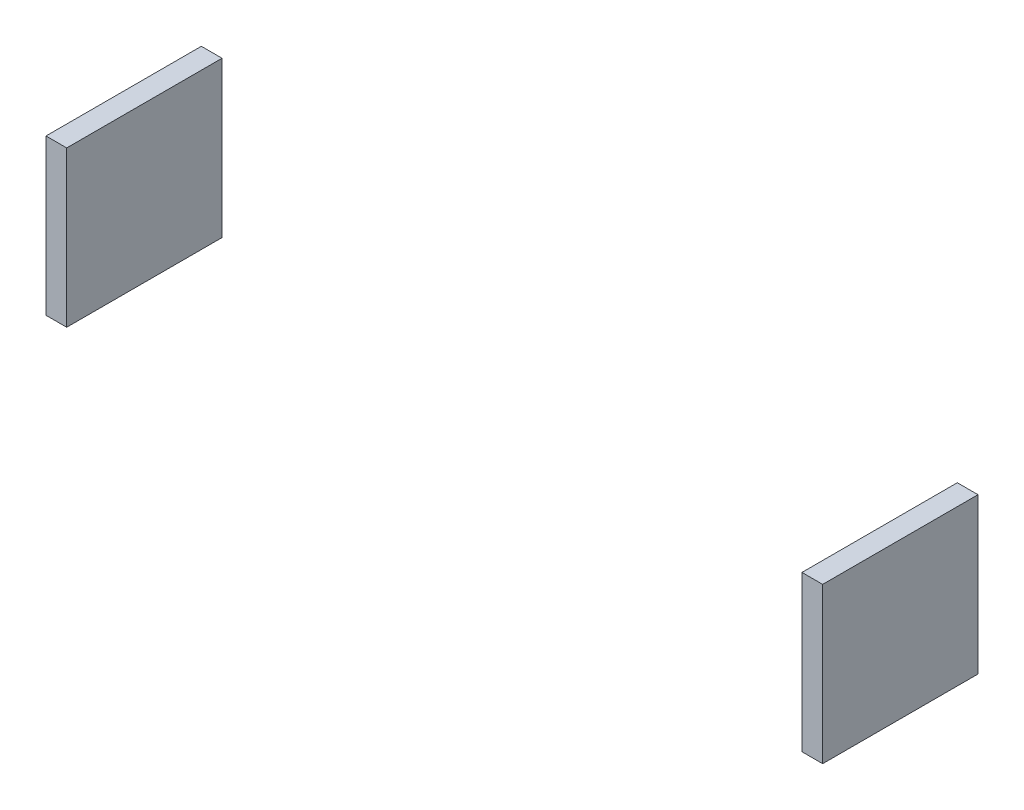
ISO-10303-21;
HEADER;
FILE_DESCRIPTION(('STEP AP214'),'2;1');
FILE_NAME('part.step','',(''),(''),'','','');
FILE_SCHEMA(('AUTOMOTIVE_DESIGN { 1 0 10303 214 1 1 1 1 }'));
ENDSEC;
DATA;
#1=APPLICATION_CONTEXT('core data for automotive mechanical design processes');
#2=APPLICATION_PROTOCOL_DEFINITION('international standard','automotive_design',2000,#1);
#3=PRODUCT_CONTEXT('',#1,'mechanical');
#4=PRODUCT('Part','Part','',(#3));
#5=PRODUCT_RELATED_PRODUCT_CATEGORY('part','',(#4));
#6=PRODUCT_DEFINITION_FORMATION('','',#4);
#7=PRODUCT_DEFINITION_CONTEXT('part definition',#1,'design');
#8=PRODUCT_DEFINITION('design','',#6,#7);
#9=PRODUCT_DEFINITION_SHAPE('','',#8);
#10=(LENGTH_UNIT() NAMED_UNIT(*) SI_UNIT(.MILLI.,.METRE.));
#11=(NAMED_UNIT(*) PLANE_ANGLE_UNIT() SI_UNIT($,.RADIAN.));
#12=(NAMED_UNIT(*) SI_UNIT($,.STERADIAN.) SOLID_ANGLE_UNIT());
#13=UNCERTAINTY_MEASURE_WITH_UNIT(LENGTH_MEASURE(1.E-05),#10,'distance_accuracy_value','');
#14=(GEOMETRIC_REPRESENTATION_CONTEXT(3) GLOBAL_UNCERTAINTY_ASSIGNED_CONTEXT((#13)) GLOBAL_UNIT_ASSIGNED_CONTEXT((#10,
#11,#12)) REPRESENTATION_CONTEXT('',''));
#15=CARTESIAN_POINT('',(0.,0.,0.));
#16=DIRECTION('',(0.,0.,1.));
#17=DIRECTION('',(1.,0.,0.));
#18=AXIS2_PLACEMENT_3D('',#15,#16,#17);
#19=CARTESIAN_POINT('',(3.75,-0.75,0.));
#20=DIRECTION('',(1.,0.,0.));
#21=DIRECTION('',(0.,0.,-1.));
#22=AXIS2_PLACEMENT_3D('',#19,#20,#21);
#23=PLANE('',#22);
#24=DIRECTION('',(0.,0.,1.));
#25=VECTOR('',#24,1.);
#26=CARTESIAN_POINT('',(3.75,0.75,0.));
#27=LINE('',#26,#25);
#28=CARTESIAN_POINT('',(3.75,0.75,0.));
#29=VERTEX_POINT('',#28);
#30=CARTESIAN_POINT('',(3.75,0.75,-1.5));
#31=VERTEX_POINT('',#30);
#32=EDGE_CURVE('P0_E20',#29,#31,#27,.F.);
#33=ORIENTED_EDGE('',*,*,#32,.F.);
#34=DIRECTION('',(0.,1.,0.));
#35=VECTOR('',#34,1.);
#36=CARTESIAN_POINT('',(3.75,0.75,0.));
#37=LINE('',#36,#35);
#38=CARTESIAN_POINT('',(3.75,-0.75,0.));
#39=VERTEX_POINT('',#38);
#40=EDGE_CURVE('P0_E79',#29,#39,#37,.F.);
#41=ORIENTED_EDGE('',*,*,#40,.T.);
#42=DIRECTION('',(0.,0.,-1.));
#43=VECTOR('',#42,1.);
#44=CARTESIAN_POINT('',(3.75,-0.75,0.));
#45=LINE('',#44,#43);
#46=CARTESIAN_POINT('',(3.75,-0.75,-1.5));
#47=VERTEX_POINT('',#46);
#48=EDGE_CURVE('P0_E61',#47,#39,#45,.F.);
#49=ORIENTED_EDGE('',*,*,#48,.F.);
#50=DIRECTION('',(0.,1.,0.));
#51=VECTOR('',#50,1.);
#52=CARTESIAN_POINT('',(3.75,0.75,-1.5));
#53=LINE('',#52,#51);
#54=EDGE_CURVE('P0_E56',#31,#47,#53,.F.);
#55=ORIENTED_EDGE('',*,*,#54,.F.);
#56=EDGE_LOOP('',(#33,#41,#49,#55));
#57=FACE_BOUND('',#56,.T.);
#58=ADVANCED_FACE('P0_F17',(#57),#23,.T.);
#59=CARTESIAN_POINT('',(3.75,0.75,0.));
#60=DIRECTION('',(0.,1.,0.));
#61=DIRECTION('',(0.,0.,1.));
#62=AXIS2_PLACEMENT_3D('',#59,#60,#61);
#63=PLANE('',#62);
#64=DIRECTION('',(0.,0.,1.));
#65=VECTOR('',#64,1.);
#66=CARTESIAN_POINT('',(3.55,0.75,0.));
#67=LINE('',#66,#65);
#68=CARTESIAN_POINT('',(3.55,0.75,0.));
#69=VERTEX_POINT('',#68);
#70=CARTESIAN_POINT('',(3.55,0.75,-1.5));
#71=VERTEX_POINT('',#70);
#72=EDGE_CURVE('P0_E83',#69,#71,#67,.F.);
#73=ORIENTED_EDGE('',*,*,#72,.F.);
#74=DIRECTION('',(1.,0.,0.));
#75=VECTOR('',#74,1.);
#76=CARTESIAN_POINT('',(3.75,0.75,0.));
#77=LINE('',#76,#75);
#78=EDGE_CURVE('P0_E68',#69,#29,#77,.T.);
#79=ORIENTED_EDGE('',*,*,#78,.T.);
#80=ORIENTED_EDGE('',*,*,#32,.T.);
#81=DIRECTION('',(1.,0.,0.));
#82=VECTOR('',#81,1.);
#83=CARTESIAN_POINT('',(3.75,0.75,-1.5));
#84=LINE('',#83,#82);
#85=EDGE_CURVE('P0_E63',#71,#31,#84,.T.);
#86=ORIENTED_EDGE('',*,*,#85,.F.);
#87=EDGE_LOOP('',(#73,#79,#80,#86));
#88=FACE_BOUND('',#87,.T.);
#89=ADVANCED_FACE('P0_F65',(#88),#63,.T.);
#90=CARTESIAN_POINT('',(3.75,0.75,-1.5));
#91=DIRECTION('',(0.,0.,-1.));
#92=DIRECTION('',(0.,1.,0.));
#93=AXIS2_PLACEMENT_3D('',#90,#91,#92);
#94=PLANE('',#93);
#95=DIRECTION('',(0.,1.,0.));
#96=VECTOR('',#95,1.);
#97=CARTESIAN_POINT('',(3.55,0.75,-1.5));
#98=LINE('',#97,#96);
#99=CARTESIAN_POINT('',(3.55,-0.75,-1.5));
#100=VERTEX_POINT('',#99);
#101=EDGE_CURVE('P0_E72',#71,#100,#98,.F.);
#102=ORIENTED_EDGE('',*,*,#101,.F.);
#103=ORIENTED_EDGE('',*,*,#85,.T.);
#104=ORIENTED_EDGE('',*,*,#54,.T.);
#105=DIRECTION('',(1.,0.,0.));
#106=VECTOR('',#105,1.);
#107=CARTESIAN_POINT('',(3.55,-0.75,-1.5));
#108=LINE('',#107,#106);
#109=EDGE_CURVE('P0_E74',#100,#47,#108,.T.);
#110=ORIENTED_EDGE('',*,*,#109,.F.);
#111=EDGE_LOOP('',(#102,#103,#104,#110));
#112=FACE_BOUND('',#111,.T.);
#113=ADVANCED_FACE('P0_F70',(#112),#94,.T.);
#114=CARTESIAN_POINT('',(3.55,-0.75,0.));
#115=DIRECTION('',(0.,-1.,0.));
#116=DIRECTION('',(0.,0.,-1.));
#117=AXIS2_PLACEMENT_3D('',#114,#115,#116);
#118=PLANE('',#117);
#119=ORIENTED_EDGE('',*,*,#48,.T.);
#120=DIRECTION('',(1.,0.,0.));
#121=VECTOR('',#120,1.);
#122=CARTESIAN_POINT('',(3.75,-0.75,0.));
#123=LINE('',#122,#121);
#124=CARTESIAN_POINT('',(3.55,-0.75,0.));
#125=VERTEX_POINT('',#124);
#126=EDGE_CURVE('P0_E35',#39,#125,#123,.F.);
#127=ORIENTED_EDGE('',*,*,#126,.T.);
#128=DIRECTION('',(0.,0.,1.));
#129=VECTOR('',#128,1.);
#130=CARTESIAN_POINT('',(3.55,-0.75,0.));
#131=LINE('',#130,#129);
#132=EDGE_CURVE('P0_E26',#100,#125,#131,.T.);
#133=ORIENTED_EDGE('',*,*,#132,.F.);
#134=ORIENTED_EDGE('',*,*,#109,.T.);
#135=EDGE_LOOP('',(#119,#127,#133,#134));
#136=FACE_BOUND('',#135,.T.);
#137=ADVANCED_FACE('P0_F89',(#136),#118,.T.);
#138=CARTESIAN_POINT('',(3.75,0.75,0.));
#139=DIRECTION('',(0.,0.,-1.));
#140=DIRECTION('',(0.,1.,0.));
#141=AXIS2_PLACEMENT_3D('',#138,#139,#140);
#142=PLANE('',#141);
#143=DIRECTION('',(0.,1.,0.));
#144=VECTOR('',#143,1.);
#145=CARTESIAN_POINT('',(3.55,0.75,0.));
#146=LINE('',#145,#144);
#147=EDGE_CURVE('P0_E11',#125,#69,#146,.T.);
#148=ORIENTED_EDGE('',*,*,#147,.F.);
#149=ORIENTED_EDGE('',*,*,#126,.F.);
#150=ORIENTED_EDGE('',*,*,#40,.F.);
#151=ORIENTED_EDGE('',*,*,#78,.F.);
#152=EDGE_LOOP('',(#148,#149,#150,#151));
#153=FACE_BOUND('',#152,.T.);
#154=ADVANCED_FACE('P0_F91',(#153),#142,.F.);
#155=CARTESIAN_POINT('',(3.55,0.75,0.));
#156=DIRECTION('',(-1.,0.,0.));
#157=DIRECTION('',(0.,0.,1.));
#158=AXIS2_PLACEMENT_3D('',#155,#156,#157);
#159=PLANE('',#158);
#160=ORIENTED_EDGE('',*,*,#132,.T.);
#161=ORIENTED_EDGE('',*,*,#147,.T.);
#162=ORIENTED_EDGE('',*,*,#72,.T.);
#163=ORIENTED_EDGE('',*,*,#101,.T.);
#164=EDGE_LOOP('',(#160,#161,#162,#163));
#165=FACE_BOUND('',#164,.T.);
#166=ADVANCED_FACE('P0_F88',(#165),#159,.T.);
#167=CLOSED_SHELL('',(#58,#89,#113,#137,#154,#166));
#168=MANIFOLD_SOLID_BREP('P0_B1',#167);
#169=CARTESIAN_POINT('',(-3.55,-0.75,0.));
#170=DIRECTION('',(1.,0.,0.));
#171=DIRECTION('',(0.,0.,-1.));
#172=AXIS2_PLACEMENT_3D('',#169,#170,#171);
#173=PLANE('',#172);
#174=DIRECTION('',(0.,0.,1.));
#175=VECTOR('',#174,1.);
#176=CARTESIAN_POINT('',(-3.55,0.75,0.));
#177=LINE('',#176,#175);
#178=CARTESIAN_POINT('',(-3.55,0.75,0.));
#179=VERTEX_POINT('',#178);
#180=CARTESIAN_POINT('',(-3.55,0.75,-1.5));
#181=VERTEX_POINT('',#180);
#182=EDGE_CURVE('P1_E20',#179,#181,#177,.F.);
#183=ORIENTED_EDGE('',*,*,#182,.F.);
#184=DIRECTION('',(0.,1.,0.));
#185=VECTOR('',#184,1.);
#186=CARTESIAN_POINT('',(-3.55,0.75,0.));
#187=LINE('',#186,#185);
#188=CARTESIAN_POINT('',(-3.55,-0.75,0.));
#189=VERTEX_POINT('',#188);
#190=EDGE_CURVE('P1_E79',#179,#189,#187,.F.);
#191=ORIENTED_EDGE('',*,*,#190,.T.);
#192=DIRECTION('',(0.,0.,-1.));
#193=VECTOR('',#192,1.);
#194=CARTESIAN_POINT('',(-3.55,-0.75,0.));
#195=LINE('',#194,#193);
#196=CARTESIAN_POINT('',(-3.55,-0.75,-1.5));
#197=VERTEX_POINT('',#196);
#198=EDGE_CURVE('P1_E61',#197,#189,#195,.F.);
#199=ORIENTED_EDGE('',*,*,#198,.F.);
#200=DIRECTION('',(0.,1.,0.));
#201=VECTOR('',#200,1.);
#202=CARTESIAN_POINT('',(-3.55,0.75,-1.5));
#203=LINE('',#202,#201);
#204=EDGE_CURVE('P1_E56',#181,#197,#203,.F.);
#205=ORIENTED_EDGE('',*,*,#204,.F.);
#206=EDGE_LOOP('',(#183,#191,#199,#205));
#207=FACE_BOUND('',#206,.T.);
#208=ADVANCED_FACE('P1_F17',(#207),#173,.T.);
#209=CARTESIAN_POINT('',(-3.55,0.75,0.));
#210=DIRECTION('',(0.,1.,0.));
#211=DIRECTION('',(0.,0.,1.));
#212=AXIS2_PLACEMENT_3D('',#209,#210,#211);
#213=PLANE('',#212);
#214=DIRECTION('',(0.,0.,1.));
#215=VECTOR('',#214,1.);
#216=CARTESIAN_POINT('',(-3.75,0.75,0.));
#217=LINE('',#216,#215);
#218=CARTESIAN_POINT('',(-3.75,0.75,0.));
#219=VERTEX_POINT('',#218);
#220=CARTESIAN_POINT('',(-3.75,0.75,-1.5));
#221=VERTEX_POINT('',#220);
#222=EDGE_CURVE('P1_E83',#219,#221,#217,.F.);
#223=ORIENTED_EDGE('',*,*,#222,.F.);
#224=DIRECTION('',(1.,0.,0.));
#225=VECTOR('',#224,1.);
#226=CARTESIAN_POINT('',(-3.55,0.75,0.));
#227=LINE('',#226,#225);
#228=EDGE_CURVE('P1_E68',#219,#179,#227,.T.);
#229=ORIENTED_EDGE('',*,*,#228,.T.);
#230=ORIENTED_EDGE('',*,*,#182,.T.);
#231=DIRECTION('',(1.,0.,0.));
#232=VECTOR('',#231,1.);
#233=CARTESIAN_POINT('',(-3.55,0.75,-1.5));
#234=LINE('',#233,#232);
#235=EDGE_CURVE('P1_E63',#221,#181,#234,.T.);
#236=ORIENTED_EDGE('',*,*,#235,.F.);
#237=EDGE_LOOP('',(#223,#229,#230,#236));
#238=FACE_BOUND('',#237,.T.);
#239=ADVANCED_FACE('P1_F65',(#238),#213,.T.);
#240=CARTESIAN_POINT('',(-3.55,0.75,-1.5));
#241=DIRECTION('',(0.,0.,-1.));
#242=DIRECTION('',(0.,1.,0.));
#243=AXIS2_PLACEMENT_3D('',#240,#241,#242);
#244=PLANE('',#243);
#245=DIRECTION('',(0.,1.,0.));
#246=VECTOR('',#245,1.);
#247=CARTESIAN_POINT('',(-3.75,0.75,-1.5));
#248=LINE('',#247,#246);
#249=CARTESIAN_POINT('',(-3.75,-0.75,-1.5));
#250=VERTEX_POINT('',#249);
#251=EDGE_CURVE('P1_E72',#221,#250,#248,.F.);
#252=ORIENTED_EDGE('',*,*,#251,.F.);
#253=ORIENTED_EDGE('',*,*,#235,.T.);
#254=ORIENTED_EDGE('',*,*,#204,.T.);
#255=DIRECTION('',(1.,0.,0.));
#256=VECTOR('',#255,1.);
#257=CARTESIAN_POINT('',(-3.75,-0.75,-1.5));
#258=LINE('',#257,#256);
#259=EDGE_CURVE('P1_E74',#250,#197,#258,.T.);
#260=ORIENTED_EDGE('',*,*,#259,.F.);
#261=EDGE_LOOP('',(#252,#253,#254,#260));
#262=FACE_BOUND('',#261,.T.);
#263=ADVANCED_FACE('P1_F70',(#262),#244,.T.);
#264=CARTESIAN_POINT('',(-3.75,-0.75,0.));
#265=DIRECTION('',(0.,-1.,0.));
#266=DIRECTION('',(0.,0.,-1.));
#267=AXIS2_PLACEMENT_3D('',#264,#265,#266);
#268=PLANE('',#267);
#269=ORIENTED_EDGE('',*,*,#198,.T.);
#270=DIRECTION('',(1.,0.,0.));
#271=VECTOR('',#270,1.);
#272=CARTESIAN_POINT('',(-3.55,-0.75,0.));
#273=LINE('',#272,#271);
#274=CARTESIAN_POINT('',(-3.75,-0.75,0.));
#275=VERTEX_POINT('',#274);
#276=EDGE_CURVE('P1_E35',#189,#275,#273,.F.);
#277=ORIENTED_EDGE('',*,*,#276,.T.);
#278=DIRECTION('',(0.,0.,1.));
#279=VECTOR('',#278,1.);
#280=CARTESIAN_POINT('',(-3.75,-0.75,0.));
#281=LINE('',#280,#279);
#282=EDGE_CURVE('P1_E26',#250,#275,#281,.T.);
#283=ORIENTED_EDGE('',*,*,#282,.F.);
#284=ORIENTED_EDGE('',*,*,#259,.T.);
#285=EDGE_LOOP('',(#269,#277,#283,#284));
#286=FACE_BOUND('',#285,.T.);
#287=ADVANCED_FACE('P1_F89',(#286),#268,.T.);
#288=CARTESIAN_POINT('',(-3.55,0.75,0.));
#289=DIRECTION('',(0.,0.,-1.));
#290=DIRECTION('',(0.,1.,0.));
#291=AXIS2_PLACEMENT_3D('',#288,#289,#290);
#292=PLANE('',#291);
#293=DIRECTION('',(0.,1.,0.));
#294=VECTOR('',#293,1.);
#295=CARTESIAN_POINT('',(-3.75,0.75,0.));
#296=LINE('',#295,#294);
#297=EDGE_CURVE('P1_E11',#275,#219,#296,.T.);
#298=ORIENTED_EDGE('',*,*,#297,.F.);
#299=ORIENTED_EDGE('',*,*,#276,.F.);
#300=ORIENTED_EDGE('',*,*,#190,.F.);
#301=ORIENTED_EDGE('',*,*,#228,.F.);
#302=EDGE_LOOP('',(#298,#299,#300,#301));
#303=FACE_BOUND('',#302,.T.);
#304=ADVANCED_FACE('P1_F91',(#303),#292,.F.);
#305=CARTESIAN_POINT('',(-3.75,0.75,0.));
#306=DIRECTION('',(-1.,0.,0.));
#307=DIRECTION('',(0.,0.,1.));
#308=AXIS2_PLACEMENT_3D('',#305,#306,#307);
#309=PLANE('',#308);
#310=ORIENTED_EDGE('',*,*,#282,.T.);
#311=ORIENTED_EDGE('',*,*,#297,.T.);
#312=ORIENTED_EDGE('',*,*,#222,.T.);
#313=ORIENTED_EDGE('',*,*,#251,.T.);
#314=EDGE_LOOP('',(#310,#311,#312,#313));
#315=FACE_BOUND('',#314,.T.);
#316=ADVANCED_FACE('P1_F88',(#315),#309,.T.);
#317=CLOSED_SHELL('',(#208,#239,#263,#287,#304,#316));
#318=MANIFOLD_SOLID_BREP('P1_B1',#317);
#319=ADVANCED_BREP_SHAPE_REPRESENTATION('',(#18,#168,#318),#14);
#320=SHAPE_DEFINITION_REPRESENTATION(#9,#319);
ENDSEC;
END-ISO-10303-21;
